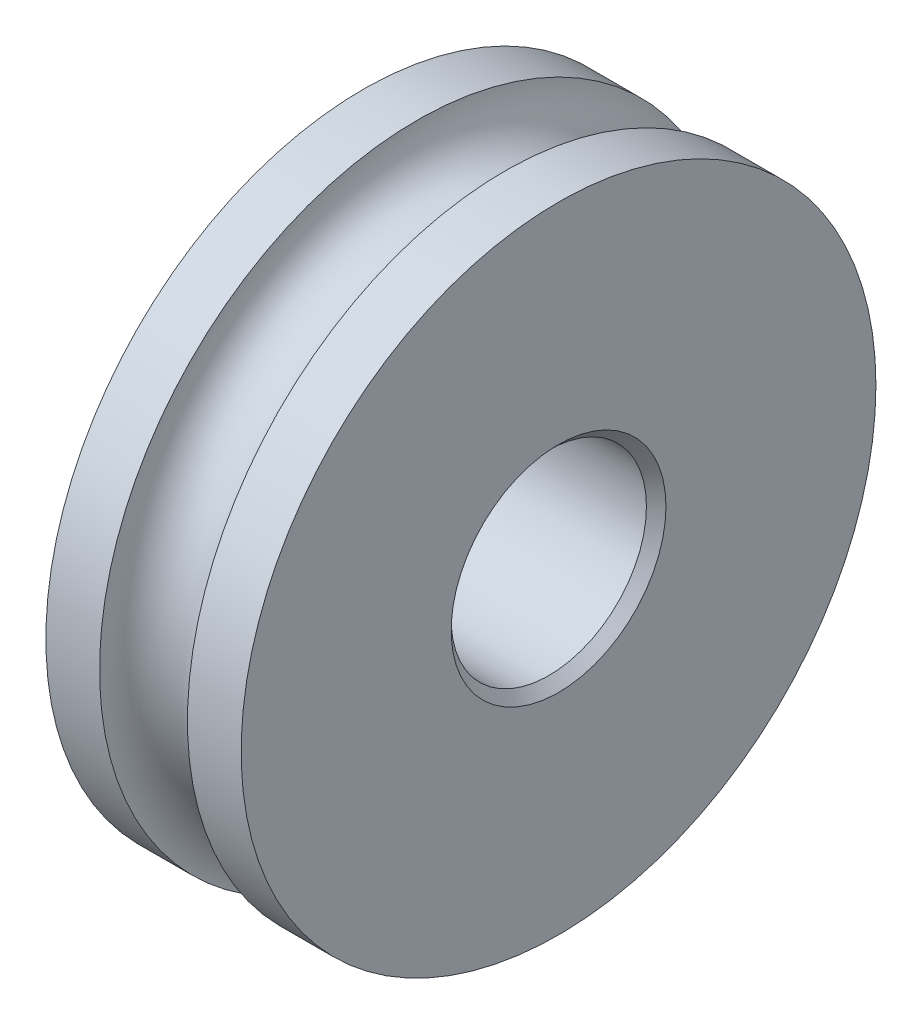
ISO-10303-21;
HEADER;
FILE_DESCRIPTION(('STEP AP214'),'2;1');
FILE_NAME('part.step','',(''),(''),'','','');
FILE_SCHEMA(('AUTOMOTIVE_DESIGN { 1 0 10303 214 1 1 1 1 }'));
ENDSEC;
DATA;
#1=APPLICATION_CONTEXT('core data for automotive mechanical design processes');
#2=APPLICATION_PROTOCOL_DEFINITION('international standard','automotive_design',2000,#1);
#3=PRODUCT_CONTEXT('',#1,'mechanical');
#4=PRODUCT('Part','Part','',(#3));
#5=PRODUCT_RELATED_PRODUCT_CATEGORY('part','',(#4));
#6=PRODUCT_DEFINITION_FORMATION('','',#4);
#7=PRODUCT_DEFINITION_CONTEXT('part definition',#1,'design');
#8=PRODUCT_DEFINITION('design','',#6,#7);
#9=PRODUCT_DEFINITION_SHAPE('','',#8);
#10=(LENGTH_UNIT() NAMED_UNIT(*) SI_UNIT(.MILLI.,.METRE.));
#11=(NAMED_UNIT(*) PLANE_ANGLE_UNIT() SI_UNIT($,.RADIAN.));
#12=(NAMED_UNIT(*) SI_UNIT($,.STERADIAN.) SOLID_ANGLE_UNIT());
#13=UNCERTAINTY_MEASURE_WITH_UNIT(LENGTH_MEASURE(1.E-05),#10,'distance_accuracy_value','');
#14=(GEOMETRIC_REPRESENTATION_CONTEXT(3) GLOBAL_UNCERTAINTY_ASSIGNED_CONTEXT((#13)) GLOBAL_UNIT_ASSIGNED_CONTEXT((#10,
#11,#12)) REPRESENTATION_CONTEXT('',''));
#15=CARTESIAN_POINT('',(0.,0.,0.));
#16=DIRECTION('',(0.,0.,1.));
#17=DIRECTION('',(1.,0.,0.));
#18=AXIS2_PLACEMENT_3D('',#15,#16,#17);
#19=CARTESIAN_POINT('',(0.,2.,0.));
#20=DIRECTION('',(-1.,0.,0.));
#21=DIRECTION('',(0.,0.,1.));
#22=AXIS2_PLACEMENT_3D('',#19,#20,#21);
#23=PLANE('',#22);
#24=CARTESIAN_POINT('',(0.,0.,0.));
#25=DIRECTION('',(-1.,0.,0.));
#26=DIRECTION('',(0.,0.,1.));
#27=AXIS2_PLACEMENT_3D('',#24,#25,#26);
#28=CIRCLE('',#27,2.2);
#29=CARTESIAN_POINT('',(0.,0.,2.2));
#30=VERTEX_POINT('',#29);
#31=EDGE_CURVE('E49',#30,#30,#28,.F.);
#32=ORIENTED_EDGE('',*,*,#31,.T.);
#33=EDGE_LOOP('',(#32));
#34=FACE_BOUND('',#33,.T.);
#35=CARTESIAN_POINT('',(0.,0.,0.));
#36=DIRECTION('',(1.,0.,0.));
#37=DIRECTION('',(0.,0.,-1.));
#38=AXIS2_PLACEMENT_3D('',#35,#36,#37);
#39=CIRCLE('',#38,6.5);
#40=CARTESIAN_POINT('',(0.,0.,-6.5));
#41=VERTEX_POINT('',#40);
#42=EDGE_CURVE('E63',#41,#41,#39,.T.);
#43=ORIENTED_EDGE('',*,*,#42,.F.);
#44=EDGE_LOOP('',(#43));
#45=FACE_BOUND('',#44,.T.);
#46=ADVANCED_FACE('F34',(#34,#45),#23,.T.);
#47=CARTESIAN_POINT('',(7.18815515975983,0.,0.));
#48=DIRECTION('',(1.,0.,0.));
#49=DIRECTION('',(0.,0.,-1.));
#50=AXIS2_PLACEMENT_3D('',#47,#48,#49);
#51=CYLINDRICAL_SURFACE('',#50,2.);
#52=CARTESIAN_POINT('',(0.200000000000001,0.,0.));
#53=DIRECTION('',(-1.,0.,0.));
#54=DIRECTION('',(0.,0.,1.));
#55=AXIS2_PLACEMENT_3D('',#52,#53,#54);
#56=CIRCLE('',#55,2.);
#57=CARTESIAN_POINT('',(0.200000000000001,0.,2.));
#58=VERTEX_POINT('',#57);
#59=EDGE_CURVE('E41',#58,#58,#56,.T.);
#60=ORIENTED_EDGE('',*,*,#59,.T.);
#61=EDGE_LOOP('',(#60));
#62=FACE_BOUND('',#61,.T.);
#63=CARTESIAN_POINT('',(3.80000000000001,0.,0.));
#64=DIRECTION('',(1.,0.,0.));
#65=DIRECTION('',(0.,0.,-1.));
#66=AXIS2_PLACEMENT_3D('',#63,#64,#65);
#67=CIRCLE('',#66,2.);
#68=CARTESIAN_POINT('',(3.80000000000001,0.,-2.));
#69=VERTEX_POINT('',#68);
#70=EDGE_CURVE('E45',#69,#69,#67,.T.);
#71=ORIENTED_EDGE('',*,*,#70,.T.);
#72=EDGE_LOOP('',(#71));
#73=FACE_BOUND('',#72,.T.);
#74=ADVANCED_FACE('F71',(#62,#73),#51,.F.);
#75=CARTESIAN_POINT('',(4.,2.,0.));
#76=DIRECTION('',(1.,0.,0.));
#77=DIRECTION('',(0.,0.,-1.));
#78=AXIS2_PLACEMENT_3D('',#75,#76,#77);
#79=PLANE('',#78);
#80=CARTESIAN_POINT('',(4.,0.,0.));
#81=DIRECTION('',(1.,0.,0.));
#82=DIRECTION('',(0.,0.,-1.));
#83=AXIS2_PLACEMENT_3D('',#80,#81,#82);
#84=CIRCLE('',#83,2.2);
#85=CARTESIAN_POINT('',(4.,0.,-2.2));
#86=VERTEX_POINT('',#85);
#87=EDGE_CURVE('E10',#86,#86,#84,.F.);
#88=ORIENTED_EDGE('',*,*,#87,.T.);
#89=EDGE_LOOP('',(#88));
#90=FACE_BOUND('',#89,.T.);
#91=CARTESIAN_POINT('',(4.,0.,0.));
#92=DIRECTION('',(1.,0.,0.));
#93=DIRECTION('',(0.,0.,-1.));
#94=AXIS2_PLACEMENT_3D('',#91,#92,#93);
#95=CIRCLE('',#94,6.5);
#96=CARTESIAN_POINT('',(4.,0.,-6.5));
#97=VERTEX_POINT('',#96);
#98=EDGE_CURVE('E54',#97,#97,#95,.T.);
#99=ORIENTED_EDGE('',*,*,#98,.T.);
#100=EDGE_LOOP('',(#99));
#101=FACE_BOUND('',#100,.T.);
#102=ADVANCED_FACE('F77',(#90,#101),#79,.T.);
#103=CARTESIAN_POINT('',(7.18815515975983,0.,0.));
#104=DIRECTION('',(1.,0.,0.));
#105=DIRECTION('',(0.,0.,-1.));
#106=AXIS2_PLACEMENT_3D('',#103,#104,#105);
#107=CYLINDRICAL_SURFACE('',#106,6.5);
#108=CARTESIAN_POINT('',(2.9,0.,0.));
#109=DIRECTION('',(1.,0.,0.));
#110=DIRECTION('',(0.,0.,-1.));
#111=AXIS2_PLACEMENT_3D('',#108,#109,#110);
#112=CIRCLE('',#111,6.5);
#113=CARTESIAN_POINT('',(2.9,0.,-6.5));
#114=VERTEX_POINT('',#113);
#115=EDGE_CURVE('E57',#114,#114,#112,.T.);
#116=ORIENTED_EDGE('',*,*,#115,.T.);
#117=EDGE_LOOP('',(#116));
#118=FACE_BOUND('',#117,.T.);
#119=ORIENTED_EDGE('',*,*,#98,.F.);
#120=EDGE_LOOP('',(#119));
#121=FACE_BOUND('',#120,.T.);
#122=ADVANCED_FACE('F95',(#118,#121),#107,.T.);
#123=CARTESIAN_POINT('',(2.,0.,0.));
#124=DIRECTION('',(1.,0.,0.));
#125=DIRECTION('',(0.,0.,-1.));
#126=AXIS2_PLACEMENT_3D('',#123,#124,#125);
#127=TOROIDAL_SURFACE('',#126,6.5,0.9);
#128=CARTESIAN_POINT('',(1.1,0.,0.));
#129=DIRECTION('',(1.,0.,0.));
#130=DIRECTION('',(0.,0.,-1.));
#131=AXIS2_PLACEMENT_3D('',#128,#129,#130);
#132=CIRCLE('',#131,6.5);
#133=CARTESIAN_POINT('',(1.1,0.,-6.5));
#134=VERTEX_POINT('',#133);
#135=EDGE_CURVE('E60',#134,#134,#132,.T.);
#136=ORIENTED_EDGE('',*,*,#135,.T.);
#137=EDGE_LOOP('',(#136));
#138=FACE_BOUND('',#137,.T.);
#139=ORIENTED_EDGE('',*,*,#115,.F.);
#140=EDGE_LOOP('',(#139));
#141=FACE_BOUND('',#140,.T.);
#142=ADVANCED_FACE('F88',(#138,#141),#127,.F.);
#143=CARTESIAN_POINT('',(7.18815515975983,0.,0.));
#144=DIRECTION('',(1.,0.,0.));
#145=DIRECTION('',(0.,0.,-1.));
#146=AXIS2_PLACEMENT_3D('',#143,#144,#145);
#147=CYLINDRICAL_SURFACE('',#146,6.5);
#148=ORIENTED_EDGE('',*,*,#42,.T.);
#149=EDGE_LOOP('',(#148));
#150=FACE_BOUND('',#149,.T.);
#151=ORIENTED_EDGE('',*,*,#135,.F.);
#152=EDGE_LOOP('',(#151));
#153=FACE_BOUND('',#152,.T.);
#154=ADVANCED_FACE('F67',(#150,#153),#147,.T.);
#155=CARTESIAN_POINT('',(0.,0.,0.));
#156=DIRECTION('',(-1.,0.,0.));
#157=DIRECTION('',(0.,0.,1.));
#158=AXIS2_PLACEMENT_3D('',#155,#156,#157);
#159=CONICAL_SURFACE('',#158,2.2,0.785398163397448);
#160=ORIENTED_EDGE('',*,*,#59,.F.);
#161=EDGE_LOOP('',(#160));
#162=FACE_BOUND('',#161,.T.);
#163=ORIENTED_EDGE('',*,*,#31,.F.);
#164=EDGE_LOOP('',(#163));
#165=FACE_BOUND('',#164,.T.);
#166=ADVANCED_FACE('F80',(#162,#165),#159,.F.);
#167=CARTESIAN_POINT('',(3.80000000000001,0.,0.));
#168=DIRECTION('',(1.,0.,0.));
#169=DIRECTION('',(0.,0.,-1.));
#170=AXIS2_PLACEMENT_3D('',#167,#168,#169);
#171=CONICAL_SURFACE('',#170,2.,0.785398163397453);
#172=ORIENTED_EDGE('',*,*,#87,.F.);
#173=EDGE_LOOP('',(#172));
#174=FACE_BOUND('',#173,.T.);
#175=ORIENTED_EDGE('',*,*,#70,.F.);
#176=EDGE_LOOP('',(#175));
#177=FACE_BOUND('',#176,.T.);
#178=ADVANCED_FACE('F36',(#174,#177),#171,.F.);
#179=CLOSED_SHELL('',(#46,#74,#102,#122,#142,#154,#166,#178));
#180=MANIFOLD_SOLID_BREP('B2',#179);
#181=ADVANCED_BREP_SHAPE_REPRESENTATION('',(#18,#180),#14);
#182=SHAPE_DEFINITION_REPRESENTATION(#9,#181);
ENDSEC;
END-ISO-10303-21;
